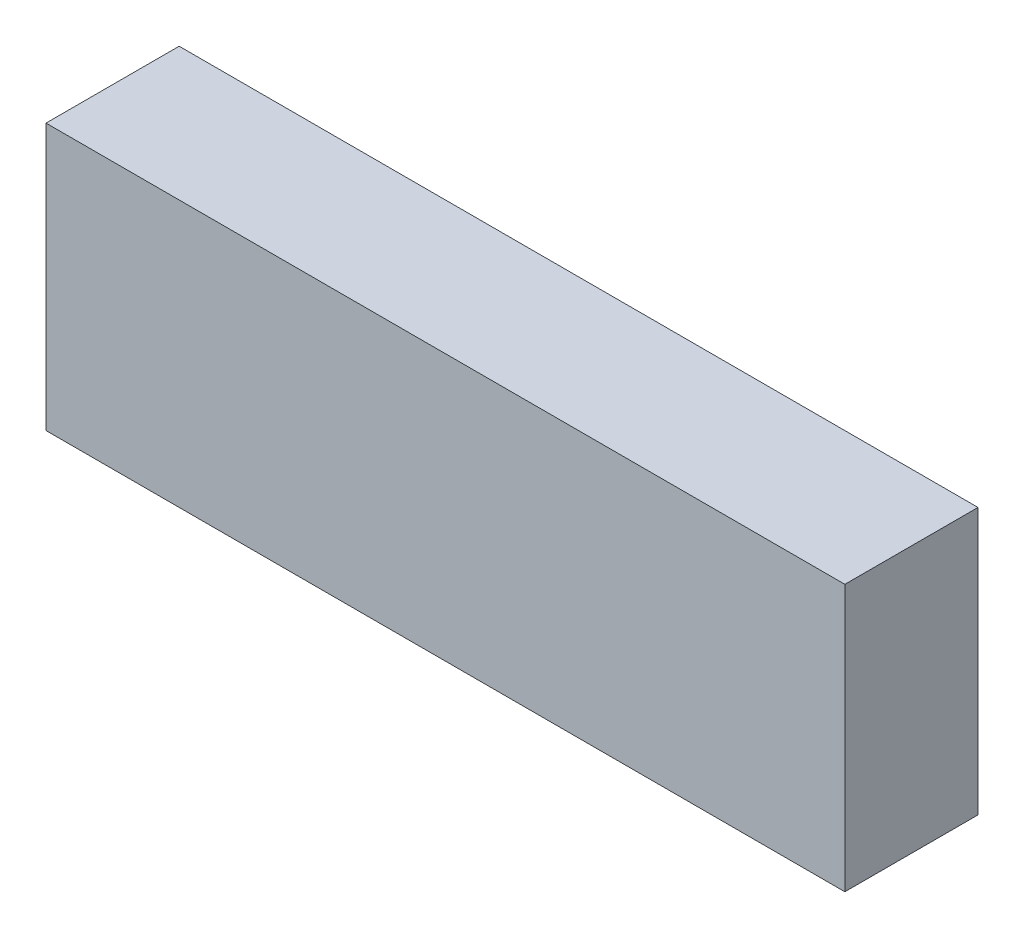
ISO-10303-21;
HEADER;
FILE_DESCRIPTION(('STEP AP214'),'2;1');
FILE_NAME('part.step','',(''),(''),'','','');
FILE_SCHEMA(('AUTOMOTIVE_DESIGN { 1 0 10303 214 1 1 1 1 }'));
ENDSEC;
DATA;
#1=APPLICATION_CONTEXT('core data for automotive mechanical design processes');
#2=APPLICATION_PROTOCOL_DEFINITION('international standard','automotive_design',2000,#1);
#3=PRODUCT_CONTEXT('',#1,'mechanical');
#4=PRODUCT('Part','Part','',(#3));
#5=PRODUCT_RELATED_PRODUCT_CATEGORY('part','',(#4));
#6=PRODUCT_DEFINITION_FORMATION('','',#4);
#7=PRODUCT_DEFINITION_CONTEXT('part definition',#1,'design');
#8=PRODUCT_DEFINITION('design','',#6,#7);
#9=PRODUCT_DEFINITION_SHAPE('','',#8);
#10=(LENGTH_UNIT() NAMED_UNIT(*) SI_UNIT(.MILLI.,.METRE.));
#11=(NAMED_UNIT(*) PLANE_ANGLE_UNIT() SI_UNIT($,.RADIAN.));
#12=(NAMED_UNIT(*) SI_UNIT($,.STERADIAN.) SOLID_ANGLE_UNIT());
#13=UNCERTAINTY_MEASURE_WITH_UNIT(LENGTH_MEASURE(1.E-05),#10,'distance_accuracy_value','');
#14=(GEOMETRIC_REPRESENTATION_CONTEXT(3) GLOBAL_UNCERTAINTY_ASSIGNED_CONTEXT((#13)) GLOBAL_UNIT_ASSIGNED_CONTEXT((#10,
#11,#12)) REPRESENTATION_CONTEXT('',''));
#15=CARTESIAN_POINT('',(0.,0.,0.));
#16=DIRECTION('',(0.,0.,1.));
#17=DIRECTION('',(1.,0.,0.));
#18=AXIS2_PLACEMENT_3D('',#15,#16,#17);
#19=CARTESIAN_POINT('',(-1.975,-1.875,0.));
#20=DIRECTION('',(1.,0.,0.));
#21=DIRECTION('',(0.,0.,1.));
#22=AXIS2_PLACEMENT_3D('',#19,#20,#21);
#23=PLANE('',#22);
#24=DIRECTION('',(0.,1.,0.));
#25=VECTOR('',#24,1.);
#26=CARTESIAN_POINT('',(-1.975,-1.875,0.1));
#27=LINE('',#26,#25);
#28=CARTESIAN_POINT('',(-1.975,-1.875,0.1));
#29=VERTEX_POINT('',#28);
#30=CARTESIAN_POINT('',(-1.975,-1.675,0.1));
#31=VERTEX_POINT('',#30);
#32=EDGE_CURVE('E11',#29,#31,#27,.T.);
#33=ORIENTED_EDGE('',*,*,#32,.T.);
#34=DIRECTION('',(0.,0.,1.));
#35=VECTOR('',#34,1.);
#36=CARTESIAN_POINT('',(-1.975,-1.675,0.));
#37=LINE('',#36,#35);
#38=CARTESIAN_POINT('',(-1.975,-1.675,0.));
#39=VERTEX_POINT('',#38);
#40=EDGE_CURVE('E24',#39,#31,#37,.T.);
#41=ORIENTED_EDGE('',*,*,#40,.F.);
#42=DIRECTION('',(0.,1.,0.));
#43=VECTOR('',#42,1.);
#44=CARTESIAN_POINT('',(-1.975,-1.875,0.));
#45=LINE('',#44,#43);
#46=CARTESIAN_POINT('',(-1.975,-1.875,0.));
#47=VERTEX_POINT('',#46);
#48=EDGE_CURVE('E86',#47,#39,#45,.T.);
#49=ORIENTED_EDGE('',*,*,#48,.F.);
#50=DIRECTION('',(0.,0.,1.));
#51=VECTOR('',#50,1.);
#52=CARTESIAN_POINT('',(-1.975,-1.875,0.));
#53=LINE('',#52,#51);
#54=EDGE_CURVE('E36',#47,#29,#53,.T.);
#55=ORIENTED_EDGE('',*,*,#54,.T.);
#56=EDGE_LOOP('',(#33,#41,#49,#55));
#57=FACE_BOUND('',#56,.T.);
#58=ADVANCED_FACE('F17',(#57),#23,.F.);
#59=CARTESIAN_POINT('',(-1.375,-1.875,0.));
#60=DIRECTION('',(1.,0.,0.));
#61=DIRECTION('',(0.,0.,1.));
#62=AXIS2_PLACEMENT_3D('',#59,#60,#61);
#63=PLANE('',#62);
#64=DIRECTION('',(0.,0.,1.));
#65=VECTOR('',#64,1.);
#66=CARTESIAN_POINT('',(-1.375,-1.875,0.));
#67=LINE('',#66,#65);
#68=CARTESIAN_POINT('',(-1.375,-1.875,0.));
#69=VERTEX_POINT('',#68);
#70=CARTESIAN_POINT('',(-1.375,-1.875,0.1));
#71=VERTEX_POINT('',#70);
#72=EDGE_CURVE('E83',#69,#71,#67,.T.);
#73=ORIENTED_EDGE('',*,*,#72,.F.);
#74=DIRECTION('',(0.,1.,0.));
#75=VECTOR('',#74,1.);
#76=CARTESIAN_POINT('',(-1.375,-1.875,0.));
#77=LINE('',#76,#75);
#78=CARTESIAN_POINT('',(-1.375,-1.675,0.));
#79=VERTEX_POINT('',#78);
#80=EDGE_CURVE('E63',#69,#79,#77,.T.);
#81=ORIENTED_EDGE('',*,*,#80,.T.);
#82=DIRECTION('',(0.,0.,1.));
#83=VECTOR('',#82,1.);
#84=CARTESIAN_POINT('',(-1.375,-1.675,0.));
#85=LINE('',#84,#83);
#86=CARTESIAN_POINT('',(-1.375,-1.675,0.1));
#87=VERTEX_POINT('',#86);
#88=EDGE_CURVE('E57',#79,#87,#85,.T.);
#89=ORIENTED_EDGE('',*,*,#88,.T.);
#90=DIRECTION('',(0.,1.,0.));
#91=VECTOR('',#90,1.);
#92=CARTESIAN_POINT('',(-1.375,-1.875,0.1));
#93=LINE('',#92,#91);
#94=EDGE_CURVE('E60',#71,#87,#93,.T.);
#95=ORIENTED_EDGE('',*,*,#94,.F.);
#96=EDGE_LOOP('',(#73,#81,#89,#95));
#97=FACE_BOUND('',#96,.T.);
#98=ADVANCED_FACE('F59',(#97),#63,.T.);
#99=CARTESIAN_POINT('',(-1.975,-1.875,0.));
#100=DIRECTION('',(0.,1.,0.));
#101=DIRECTION('',(0.,0.,1.));
#102=AXIS2_PLACEMENT_3D('',#99,#100,#101);
#103=PLANE('',#102);
#104=ORIENTED_EDGE('',*,*,#72,.T.);
#105=DIRECTION('',(1.,0.,0.));
#106=VECTOR('',#105,1.);
#107=CARTESIAN_POINT('',(-1.975,-1.875,0.1));
#108=LINE('',#107,#106);
#109=EDGE_CURVE('E71',#29,#71,#108,.T.);
#110=ORIENTED_EDGE('',*,*,#109,.F.);
#111=ORIENTED_EDGE('',*,*,#54,.F.);
#112=DIRECTION('',(1.,0.,0.));
#113=VECTOR('',#112,1.);
#114=CARTESIAN_POINT('',(-1.975,-1.875,0.));
#115=LINE('',#114,#113);
#116=EDGE_CURVE('E76',#47,#69,#115,.T.);
#117=ORIENTED_EDGE('',*,*,#116,.T.);
#118=EDGE_LOOP('',(#104,#110,#111,#117));
#119=FACE_BOUND('',#118,.T.);
#120=ADVANCED_FACE('F91',(#119),#103,.F.);
#121=CARTESIAN_POINT('',(-1.975,-1.675,0.));
#122=DIRECTION('',(0.,1.,0.));
#123=DIRECTION('',(0.,0.,1.));
#124=AXIS2_PLACEMENT_3D('',#121,#122,#123);
#125=PLANE('',#124);
#126=DIRECTION('',(1.,0.,0.));
#127=VECTOR('',#126,1.);
#128=CARTESIAN_POINT('',(-1.975,-1.675,0.));
#129=LINE('',#128,#127);
#130=EDGE_CURVE('E74',#39,#79,#129,.T.);
#131=ORIENTED_EDGE('',*,*,#130,.F.);
#132=ORIENTED_EDGE('',*,*,#40,.T.);
#133=DIRECTION('',(1.,0.,0.));
#134=VECTOR('',#133,1.);
#135=CARTESIAN_POINT('',(-1.975,-1.675,0.1));
#136=LINE('',#135,#134);
#137=EDGE_CURVE('E69',#31,#87,#136,.T.);
#138=ORIENTED_EDGE('',*,*,#137,.T.);
#139=ORIENTED_EDGE('',*,*,#88,.F.);
#140=EDGE_LOOP('',(#131,#132,#138,#139));
#141=FACE_BOUND('',#140,.T.);
#142=ADVANCED_FACE('F73',(#141),#125,.T.);
#143=CARTESIAN_POINT('',(-1.975,-1.875,0.));
#144=DIRECTION('',(0.,0.,1.));
#145=DIRECTION('',(1.,0.,0.));
#146=AXIS2_PLACEMENT_3D('',#143,#144,#145);
#147=PLANE('',#146);
#148=ORIENTED_EDGE('',*,*,#130,.T.);
#149=ORIENTED_EDGE('',*,*,#80,.F.);
#150=ORIENTED_EDGE('',*,*,#116,.F.);
#151=ORIENTED_EDGE('',*,*,#48,.T.);
#152=EDGE_LOOP('',(#148,#149,#150,#151));
#153=FACE_BOUND('',#152,.T.);
#154=ADVANCED_FACE('F89',(#153),#147,.F.);
#155=CARTESIAN_POINT('',(-1.975,-1.875,0.1));
#156=DIRECTION('',(0.,0.,1.));
#157=DIRECTION('',(1.,0.,0.));
#158=AXIS2_PLACEMENT_3D('',#155,#156,#157);
#159=PLANE('',#158);
#160=ORIENTED_EDGE('',*,*,#32,.F.);
#161=ORIENTED_EDGE('',*,*,#109,.T.);
#162=ORIENTED_EDGE('',*,*,#94,.T.);
#163=ORIENTED_EDGE('',*,*,#137,.F.);
#164=EDGE_LOOP('',(#160,#161,#162,#163));
#165=FACE_BOUND('',#164,.T.);
#166=ADVANCED_FACE('F68',(#165),#159,.T.);
#167=CLOSED_SHELL('',(#58,#98,#120,#142,#154,#166));
#168=MANIFOLD_SOLID_BREP('B1',#167);
#169=ADVANCED_BREP_SHAPE_REPRESENTATION('',(#18,#168),#14);
#170=SHAPE_DEFINITION_REPRESENTATION(#9,#169);
ENDSEC;
END-ISO-10303-21;
